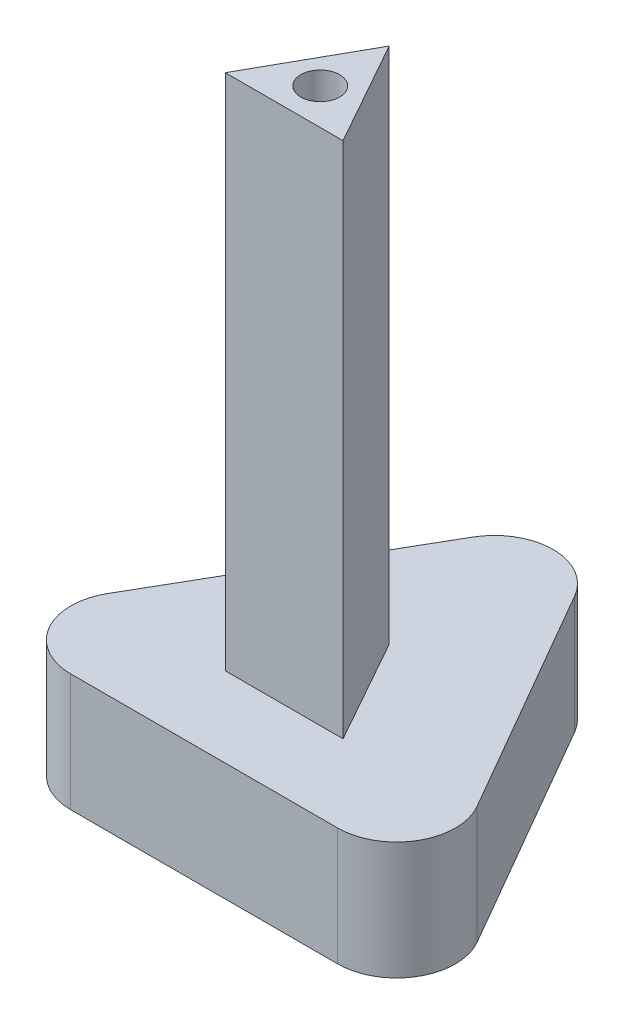
ISO-10303-21;
HEADER;
FILE_DESCRIPTION(('STEP AP214'),'2;1');
FILE_NAME('part.step','',(''),(''),'','','');
FILE_SCHEMA(('AUTOMOTIVE_DESIGN { 1 0 10303 214 1 1 1 1 }'));
ENDSEC;
DATA;
#1=APPLICATION_CONTEXT('core data for automotive mechanical design processes');
#2=APPLICATION_PROTOCOL_DEFINITION('international standard','automotive_design',2000,#1);
#3=PRODUCT_CONTEXT('',#1,'mechanical');
#4=PRODUCT('Part','Part','',(#3));
#5=PRODUCT_RELATED_PRODUCT_CATEGORY('part','',(#4));
#6=PRODUCT_DEFINITION_FORMATION('','',#4);
#7=PRODUCT_DEFINITION_CONTEXT('part definition',#1,'design');
#8=PRODUCT_DEFINITION('design','',#6,#7);
#9=PRODUCT_DEFINITION_SHAPE('','',#8);
#10=(LENGTH_UNIT() NAMED_UNIT(*) SI_UNIT(.MILLI.,.METRE.));
#11=(NAMED_UNIT(*) PLANE_ANGLE_UNIT() SI_UNIT($,.RADIAN.));
#12=(NAMED_UNIT(*) SI_UNIT($,.STERADIAN.) SOLID_ANGLE_UNIT());
#13=UNCERTAINTY_MEASURE_WITH_UNIT(LENGTH_MEASURE(1.E-05),#10,'distance_accuracy_value','');
#14=(GEOMETRIC_REPRESENTATION_CONTEXT(3) GLOBAL_UNCERTAINTY_ASSIGNED_CONTEXT((#13)) GLOBAL_UNIT_ASSIGNED_CONTEXT((#10,
#11,#12)) REPRESENTATION_CONTEXT('',''));
#15=CARTESIAN_POINT('',(0.,0.,0.));
#16=DIRECTION('',(0.,0.,1.));
#17=DIRECTION('',(1.,0.,0.));
#18=AXIS2_PLACEMENT_3D('',#15,#16,#17);
#19=CARTESIAN_POINT('',(0.,10.,0.));
#20=DIRECTION('',(0.,1.,0.));
#21=DIRECTION('',(0.,0.,1.));
#22=AXIS2_PLACEMENT_3D('',#19,#20,#21);
#23=PLANE('',#22);
#24=DIRECTION('',(1.,0.,0.));
#25=VECTOR('',#24,1.);
#26=CARTESIAN_POINT('',(-37.1130749278497,10.,31.8004158058112));
#27=LINE('',#26,#25);
#28=CARTESIAN_POINT('',(-28.4528208900053,10.,31.8004158058112));
#29=VERTEX_POINT('',#28);
#30=CARTESIAN_POINT('',(-5.7733289656941,10.,31.8004158058112));
#31=VERTEX_POINT('',#30);
#32=EDGE_CURVE('E172',#29,#31,#27,.T.);
#33=ORIENTED_EDGE('',*,*,#32,.T.);
#34=CARTESIAN_POINT('',(-5.7733289656941,10.,26.8004158058112));
#35=DIRECTION('',(0.,1.,0.));
#36=DIRECTION('',(0.,0.,1.));
#37=AXIS2_PLACEMENT_3D('',#34,#35,#36);
#38=CIRCLE('',#37,5.);
#39=CARTESIAN_POINT('',(-1.44320194677191,10.,24.3004158058112));
#40=VERTEX_POINT('',#39);
#41=EDGE_CURVE('E214',#31,#40,#38,.T.);
#42=ORIENTED_EDGE('',*,*,#41,.T.);
#43=DIRECTION('',(-0.499999999999998,0.,-0.86602540378444));
#44=VECTOR('',#43,1.);
#45=CARTESIAN_POINT('',(-17.1130749278496,10.,-2.84060034556624));
#46=LINE('',#45,#44);
#47=CARTESIAN_POINT('',(-12.7829479089274,10.,4.65939965443374));
#48=VERTEX_POINT('',#47);
#49=EDGE_CURVE('E164',#40,#48,#46,.T.);
#50=ORIENTED_EDGE('',*,*,#49,.T.);
#51=CARTESIAN_POINT('',(-17.1130749278496,10.,7.15939965443373));
#52=DIRECTION('',(0.,1.,0.));
#53=DIRECTION('',(0.,0.,1.));
#54=AXIS2_PLACEMENT_3D('',#51,#52,#53);
#55=CIRCLE('',#54,5.);
#56=CARTESIAN_POINT('',(-21.4432019467718,10.,4.65939965443371));
#57=VERTEX_POINT('',#56);
#58=EDGE_CURVE('E208',#48,#57,#55,.T.);
#59=ORIENTED_EDGE('',*,*,#58,.T.);
#60=DIRECTION('',(-0.500000000000004,0.,0.866025403784436));
#61=VECTOR('',#60,1.);
#62=CARTESIAN_POINT('',(-17.1130749278496,10.,-2.84060034556624));
#63=LINE('',#62,#61);
#64=CARTESIAN_POINT('',(-32.7829479089275,10.,24.3004158058112));
#65=VERTEX_POINT('',#64);
#66=EDGE_CURVE('E168',#57,#65,#63,.T.);
#67=ORIENTED_EDGE('',*,*,#66,.T.);
#68=CARTESIAN_POINT('',(-28.4528208900053,10.,26.8004158058112));
#69=DIRECTION('',(0.,1.,0.));
#70=DIRECTION('',(0.,0.,1.));
#71=AXIS2_PLACEMENT_3D('',#68,#69,#70);
#72=CIRCLE('',#71,5.);
#73=EDGE_CURVE('E211',#65,#29,#72,.T.);
#74=ORIENTED_EDGE('',*,*,#73,.T.);
#75=EDGE_LOOP('',(#33,#42,#50,#59,#67,#74));
#76=FACE_BOUND('',#75,.T.);
#77=DIRECTION('',(-1.,0.,0.));
#78=VECTOR('',#77,1.);
#79=CARTESIAN_POINT('',(-12.1130749278496,10.,25.011274713108));
#80=LINE('',#79,#78);
#81=CARTESIAN_POINT('',(-12.1130749278496,10.,25.011274713108));
#82=VERTEX_POINT('',#81);
#83=CARTESIAN_POINT('',(-22.1130749278496,10.,25.011274713108));
#84=VERTEX_POINT('',#83);
#85=EDGE_CURVE('E140',#82,#84,#80,.T.);
#86=ORIENTED_EDGE('',*,*,#85,.T.);
#87=DIRECTION('',(0.488747474137814,0.,-0.872425301400588));
#88=VECTOR('',#87,1.);
#89=CARTESIAN_POINT('',(-22.1130749278496,10.,25.011274713108));
#90=LINE('',#89,#88);
#91=CARTESIAN_POINT('',(-17.1130749278496,10.,16.0861615660824));
#92=VERTEX_POINT('',#91);
#93=EDGE_CURVE('E58',#84,#92,#90,.T.);
#94=ORIENTED_EDGE('',*,*,#93,.T.);
#95=DIRECTION('',(0.488747474137814,0.,0.872425301400588));
#96=VECTOR('',#95,1.);
#97=CARTESIAN_POINT('',(-17.1130749278496,10.,16.0861615660824));
#98=LINE('',#97,#96);
#99=EDGE_CURVE('E130',#92,#82,#98,.T.);
#100=ORIENTED_EDGE('',*,*,#99,.T.);
#101=EDGE_LOOP('',(#86,#94,#100));
#102=FACE_BOUND('',#101,.T.);
#103=ADVANCED_FACE('F42',(#76,#102),#23,.T.);
#104=CARTESIAN_POINT('',(-17.1130749278496,10.,-2.84060034556624));
#105=DIRECTION('',(-0.86602540378444,0.,0.499999999999998));
#106=DIRECTION('',(0.499999999999998,0.,0.86602540378444));
#107=AXIS2_PLACEMENT_3D('',#104,#105,#106);
#108=PLANE('',#107);
#109=ORIENTED_EDGE('',*,*,#49,.F.);
#110=DIRECTION('',(0.,-1.,0.));
#111=VECTOR('',#110,1.);
#112=CARTESIAN_POINT('',(-1.4432019467719,10.,24.3004158058112));
#113=LINE('',#112,#111);
#114=CARTESIAN_POINT('',(-1.44320194677191,0.,24.3004158058112));
#115=VERTEX_POINT('',#114);
#116=EDGE_CURVE('E188',#40,#115,#113,.T.);
#117=ORIENTED_EDGE('',*,*,#116,.T.);
#118=DIRECTION('',(-0.499999999999998,0.,-0.86602540378444));
#119=VECTOR('',#118,1.);
#120=CARTESIAN_POINT('',(-17.1130749278496,0.,-2.84060034556624));
#121=LINE('',#120,#119);
#122=CARTESIAN_POINT('',(-12.7829479089274,0.,4.65939965443374));
#123=VERTEX_POINT('',#122);
#124=EDGE_CURVE('E158',#115,#123,#121,.T.);
#125=ORIENTED_EDGE('',*,*,#124,.T.);
#126=DIRECTION('',(0.,-1.,0.));
#127=VECTOR('',#126,1.);
#128=CARTESIAN_POINT('',(-12.7829479089274,10.,4.65939965443374));
#129=LINE('',#128,#127);
#130=EDGE_CURVE('E176',#123,#48,#129,.F.);
#131=ORIENTED_EDGE('',*,*,#130,.T.);
#132=EDGE_LOOP('',(#109,#117,#125,#131));
#133=FACE_BOUND('',#132,.T.);
#134=ADVANCED_FACE('F243',(#133),#108,.F.);
#135=CARTESIAN_POINT('',(-17.1130749278496,10.,-2.84060034556624));
#136=DIRECTION('',(0.866025403784436,0.,0.500000000000004));
#137=DIRECTION('',(0.500000000000004,0.,-0.866025403784436));
#138=AXIS2_PLACEMENT_3D('',#135,#136,#137);
#139=PLANE('',#138);
#140=DIRECTION('',(-0.500000000000004,0.,0.866025403784436));
#141=VECTOR('',#140,1.);
#142=CARTESIAN_POINT('',(-17.1130749278496,0.,-2.84060034556624));
#143=LINE('',#142,#141);
#144=CARTESIAN_POINT('',(-21.4432019467718,0.,4.65939965443371));
#145=VERTEX_POINT('',#144);
#146=CARTESIAN_POINT('',(-32.7829479089275,0.,24.3004158058112));
#147=VERTEX_POINT('',#146);
#148=EDGE_CURVE('E180',#145,#147,#143,.T.);
#149=ORIENTED_EDGE('',*,*,#148,.T.);
#150=DIRECTION('',(0.,-1.,0.));
#151=VECTOR('',#150,1.);
#152=CARTESIAN_POINT('',(-32.7829479089275,10.,24.3004158058112));
#153=LINE('',#152,#151);
#154=EDGE_CURVE('E11',#147,#65,#153,.F.);
#155=ORIENTED_EDGE('',*,*,#154,.T.);
#156=ORIENTED_EDGE('',*,*,#66,.F.);
#157=DIRECTION('',(0.,-1.,0.));
#158=VECTOR('',#157,1.);
#159=CARTESIAN_POINT('',(-21.4432019467718,10.,4.65939965443371));
#160=LINE('',#159,#158);
#161=EDGE_CURVE('E51',#57,#145,#160,.T.);
#162=ORIENTED_EDGE('',*,*,#161,.T.);
#163=EDGE_LOOP('',(#149,#155,#156,#162));
#164=FACE_BOUND('',#163,.T.);
#165=ADVANCED_FACE('F220',(#164),#139,.F.);
#166=CARTESIAN_POINT('',(-37.1130749278497,10.,31.8004158058112));
#167=DIRECTION('',(0.,0.,-1.));
#168=DIRECTION('',(-1.,0.,0.));
#169=AXIS2_PLACEMENT_3D('',#166,#167,#168);
#170=PLANE('',#169);
#171=DIRECTION('',(1.,0.,0.));
#172=VECTOR('',#171,1.);
#173=CARTESIAN_POINT('',(-37.1130749278497,0.,31.8004158058112));
#174=LINE('',#173,#172);
#175=CARTESIAN_POINT('',(-28.4528208900053,0.,31.8004158058112));
#176=VERTEX_POINT('',#175);
#177=CARTESIAN_POINT('',(-5.7733289656941,0.,31.8004158058112));
#178=VERTEX_POINT('',#177);
#179=EDGE_CURVE('E169',#176,#178,#174,.T.);
#180=ORIENTED_EDGE('',*,*,#179,.T.);
#181=DIRECTION('',(0.,-1.,0.));
#182=VECTOR('',#181,1.);
#183=CARTESIAN_POINT('',(-5.7733289656941,10.,31.8004158058112));
#184=LINE('',#183,#182);
#185=EDGE_CURVE('E205',#178,#31,#184,.F.);
#186=ORIENTED_EDGE('',*,*,#185,.T.);
#187=ORIENTED_EDGE('',*,*,#32,.F.);
#188=DIRECTION('',(0.,-1.,0.));
#189=VECTOR('',#188,1.);
#190=CARTESIAN_POINT('',(-28.4528208900053,10.,31.8004158058112));
#191=LINE('',#190,#189);
#192=EDGE_CURVE('E201',#29,#176,#191,.T.);
#193=ORIENTED_EDGE('',*,*,#192,.T.);
#194=EDGE_LOOP('',(#180,#186,#187,#193));
#195=FACE_BOUND('',#194,.T.);
#196=ADVANCED_FACE('F233',(#195),#170,.F.);
#197=CARTESIAN_POINT('',(0.,0.,0.));
#198=DIRECTION('',(0.,1.,0.));
#199=DIRECTION('',(0.,0.,1.));
#200=AXIS2_PLACEMENT_3D('',#197,#198,#199);
#201=PLANE('',#200);
#202=ORIENTED_EDGE('',*,*,#124,.F.);
#203=CARTESIAN_POINT('',(-5.7733289656941,0.,26.8004158058112));
#204=DIRECTION('',(0.,1.,0.));
#205=DIRECTION('',(0.,0.,1.));
#206=AXIS2_PLACEMENT_3D('',#203,#204,#205);
#207=CIRCLE('',#206,5.);
#208=EDGE_CURVE('E198',#115,#178,#207,.F.);
#209=ORIENTED_EDGE('',*,*,#208,.T.);
#210=ORIENTED_EDGE('',*,*,#179,.F.);
#211=CARTESIAN_POINT('',(-28.4528208900053,0.,26.8004158058112));
#212=DIRECTION('',(0.,1.,0.));
#213=DIRECTION('',(0.,0.,1.));
#214=AXIS2_PLACEMENT_3D('',#211,#212,#213);
#215=CIRCLE('',#214,5.);
#216=EDGE_CURVE('E195',#176,#147,#215,.F.);
#217=ORIENTED_EDGE('',*,*,#216,.T.);
#218=ORIENTED_EDGE('',*,*,#148,.F.);
#219=CARTESIAN_POINT('',(-17.1130749278496,0.,7.15939965443373));
#220=DIRECTION('',(0.,1.,0.));
#221=DIRECTION('',(0.,0.,1.));
#222=AXIS2_PLACEMENT_3D('',#219,#220,#221);
#223=CIRCLE('',#222,5.);
#224=EDGE_CURVE('E192',#145,#123,#223,.F.);
#225=ORIENTED_EDGE('',*,*,#224,.T.);
#226=EDGE_LOOP('',(#202,#209,#210,#217,#218,#225));
#227=FACE_BOUND('',#226,.T.);
#228=ADVANCED_FACE('F225',(#227),#201,.F.);
#229=CARTESIAN_POINT('',(-5.7733289656941,10.,26.8004158058112));
#230=DIRECTION('',(0.,-1.,0.));
#231=DIRECTION('',(0.,0.,-1.));
#232=AXIS2_PLACEMENT_3D('',#229,#230,#231);
#233=CYLINDRICAL_SURFACE('',#232,5.);
#234=ORIENTED_EDGE('',*,*,#41,.F.);
#235=ORIENTED_EDGE('',*,*,#185,.F.);
#236=ORIENTED_EDGE('',*,*,#208,.F.);
#237=ORIENTED_EDGE('',*,*,#116,.F.);
#238=EDGE_LOOP('',(#234,#235,#236,#237));
#239=FACE_BOUND('',#238,.T.);
#240=ADVANCED_FACE('F241',(#239),#233,.T.);
#241=CARTESIAN_POINT('',(-28.4528208900053,10.,26.8004158058112));
#242=DIRECTION('',(0.,-1.,0.));
#243=DIRECTION('',(0.,0.,-1.));
#244=AXIS2_PLACEMENT_3D('',#241,#242,#243);
#245=CYLINDRICAL_SURFACE('',#244,5.);
#246=ORIENTED_EDGE('',*,*,#73,.F.);
#247=ORIENTED_EDGE('',*,*,#154,.F.);
#248=ORIENTED_EDGE('',*,*,#216,.F.);
#249=ORIENTED_EDGE('',*,*,#192,.F.);
#250=EDGE_LOOP('',(#246,#247,#248,#249));
#251=FACE_BOUND('',#250,.T.);
#252=ADVANCED_FACE('F230',(#251),#245,.T.);
#253=CARTESIAN_POINT('',(-17.1130749278496,10.,7.15939965443373));
#254=DIRECTION('',(0.,-1.,0.));
#255=DIRECTION('',(0.,0.,-1.));
#256=AXIS2_PLACEMENT_3D('',#253,#254,#255);
#257=CYLINDRICAL_SURFACE('',#256,5.);
#258=ORIENTED_EDGE('',*,*,#58,.F.);
#259=ORIENTED_EDGE('',*,*,#130,.F.);
#260=ORIENTED_EDGE('',*,*,#224,.F.);
#261=ORIENTED_EDGE('',*,*,#161,.F.);
#262=EDGE_LOOP('',(#258,#259,#260,#261));
#263=FACE_BOUND('',#262,.T.);
#264=ADVANCED_FACE('F44',(#263),#257,.T.);
#265=CARTESIAN_POINT('',(-22.1130749278496,54.,25.011274713108));
#266=DIRECTION('',(-0.872425301400588,0.,-0.488747474137814));
#267=DIRECTION('',(-0.488747474137814,0.,0.872425301400588));
#268=AXIS2_PLACEMENT_3D('',#265,#266,#267);
#269=PLANE('',#268);
#270=ORIENTED_EDGE('',*,*,#93,.F.);
#271=DIRECTION('',(0.,-1.,0.));
#272=VECTOR('',#271,1.);
#273=CARTESIAN_POINT('',(-22.1130749278496,54.,25.011274713108));
#274=LINE('',#273,#272);
#275=CARTESIAN_POINT('',(-22.1130749278496,54.,25.011274713108));
#276=VERTEX_POINT('',#275);
#277=EDGE_CURVE('E155',#276,#84,#274,.T.);
#278=ORIENTED_EDGE('',*,*,#277,.F.);
#279=DIRECTION('',(0.488747474137814,0.,-0.872425301400588));
#280=VECTOR('',#279,1.);
#281=CARTESIAN_POINT('',(-22.1130749278496,54.,25.011274713108));
#282=LINE('',#281,#280);
#283=CARTESIAN_POINT('',(-17.1130749278496,54.,16.0861615660824));
#284=VERTEX_POINT('',#283);
#285=EDGE_CURVE('E135',#276,#284,#282,.T.);
#286=ORIENTED_EDGE('',*,*,#285,.T.);
#287=DIRECTION('',(0.,-1.,0.));
#288=VECTOR('',#287,1.);
#289=CARTESIAN_POINT('',(-17.1130749278496,54.,16.0861615660824));
#290=LINE('',#289,#288);
#291=EDGE_CURVE('E147',#284,#92,#290,.T.);
#292=ORIENTED_EDGE('',*,*,#291,.T.);
#293=EDGE_LOOP('',(#270,#278,#286,#292));
#294=FACE_BOUND('',#293,.T.);
#295=ADVANCED_FACE('F246',(#294),#269,.T.);
#296=CARTESIAN_POINT('',(-12.1130749278496,54.,25.011274713108));
#297=DIRECTION('',(0.,0.,1.));
#298=DIRECTION('',(1.,0.,0.));
#299=AXIS2_PLACEMENT_3D('',#296,#297,#298);
#300=PLANE('',#299);
#301=ORIENTED_EDGE('',*,*,#85,.F.);
#302=DIRECTION('',(0.,-1.,0.));
#303=VECTOR('',#302,1.);
#304=CARTESIAN_POINT('',(-12.1130749278496,54.,25.011274713108));
#305=LINE('',#304,#303);
#306=CARTESIAN_POINT('',(-12.1130749278496,54.,25.011274713108));
#307=VERTEX_POINT('',#306);
#308=EDGE_CURVE('E159',#307,#82,#305,.T.);
#309=ORIENTED_EDGE('',*,*,#308,.F.);
#310=DIRECTION('',(-1.,0.,0.));
#311=VECTOR('',#310,1.);
#312=CARTESIAN_POINT('',(-12.1130749278496,54.,25.011274713108));
#313=LINE('',#312,#311);
#314=EDGE_CURVE('E144',#307,#276,#313,.T.);
#315=ORIENTED_EDGE('',*,*,#314,.T.);
#316=ORIENTED_EDGE('',*,*,#277,.T.);
#317=EDGE_LOOP('',(#301,#309,#315,#316));
#318=FACE_BOUND('',#317,.T.);
#319=ADVANCED_FACE('F251',(#318),#300,.T.);
#320=CARTESIAN_POINT('',(-17.1130749278496,54.,16.0861615660824));
#321=DIRECTION('',(0.872425301400588,0.,-0.488747474137814));
#322=DIRECTION('',(-0.488747474137814,0.,-0.872425301400588));
#323=AXIS2_PLACEMENT_3D('',#320,#321,#322);
#324=PLANE('',#323);
#325=ORIENTED_EDGE('',*,*,#99,.F.);
#326=ORIENTED_EDGE('',*,*,#291,.F.);
#327=DIRECTION('',(0.488747474137814,0.,0.872425301400588));
#328=VECTOR('',#327,1.);
#329=CARTESIAN_POINT('',(-17.1130749278496,54.,16.0861615660824));
#330=LINE('',#329,#328);
#331=EDGE_CURVE('E139',#284,#307,#330,.T.);
#332=ORIENTED_EDGE('',*,*,#331,.T.);
#333=ORIENTED_EDGE('',*,*,#308,.T.);
#334=EDGE_LOOP('',(#325,#326,#332,#333));
#335=FACE_BOUND('',#334,.T.);
#336=ADVANCED_FACE('F299',(#335),#324,.T.);
#337=CARTESIAN_POINT('',(0.,54.,0.));
#338=DIRECTION('',(0.,1.,0.));
#339=DIRECTION('',(0.,0.,1.));
#340=AXIS2_PLACEMENT_3D('',#337,#338,#339);
#341=PLANE('',#340);
#342=CARTESIAN_POINT('',(-17.1130749278496,54.,21.9492606082546));
#343=DIRECTION('',(0.,1.,0.));
#344=DIRECTION('',(0.,0.,1.));
#345=AXIS2_PLACEMENT_3D('',#342,#343,#344);
#346=CIRCLE('',#345,1.64999999999999);
#347=CARTESIAN_POINT('',(-17.1130749278496,54.,23.5992606082546));
#348=VERTEX_POINT('',#347);
#349=EDGE_CURVE('E126',#348,#348,#346,.T.);
#350=ORIENTED_EDGE('',*,*,#349,.F.);
#351=EDGE_LOOP('',(#350));
#352=FACE_BOUND('',#351,.T.);
#353=ORIENTED_EDGE('',*,*,#285,.F.);
#354=ORIENTED_EDGE('',*,*,#314,.F.);
#355=ORIENTED_EDGE('',*,*,#331,.F.);
#356=EDGE_LOOP('',(#353,#354,#355));
#357=FACE_BOUND('',#356,.T.);
#358=ADVANCED_FACE('F119',(#352,#357),#341,.T.);
#359=CARTESIAN_POINT('',(-17.1130749278496,43.9,21.9492606082546));
#360=DIRECTION('',(0.,1.,0.));
#361=DIRECTION('',(0.,0.,1.));
#362=AXIS2_PLACEMENT_3D('',#359,#360,#361);
#363=CONICAL_SURFACE('',#362,1.64999999999999,1.02974425867665);
#364=CARTESIAN_POINT('',(-17.1130749278496,42.9085799786045,21.9492606082546));
#365=VERTEX_POINT('',#364);
#366=VERTEX_LOOP('',#365);
#367=FACE_BOUND('',#366,.T.);
#368=CARTESIAN_POINT('',(-17.1130749278496,43.9,21.9492606082546));
#369=DIRECTION('',(0.,1.,0.));
#370=DIRECTION('',(0.,0.,1.));
#371=AXIS2_PLACEMENT_3D('',#368,#369,#370);
#372=CIRCLE('',#371,1.64999999999999);
#373=CARTESIAN_POINT('',(-17.1130749278496,43.9,23.5992606082546));
#374=VERTEX_POINT('',#373);
#375=EDGE_CURVE('E123',#374,#374,#372,.T.);
#376=ORIENTED_EDGE('',*,*,#375,.T.);
#377=EDGE_LOOP('',(#376));
#378=FACE_BOUND('',#377,.T.);
#379=ADVANCED_FACE('F115',(#367,#378),#363,.F.);
#380=CARTESIAN_POINT('',(-17.1130749278496,54.,21.9492606082546));
#381=DIRECTION('',(0.,1.,0.));
#382=DIRECTION('',(0.,0.,1.));
#383=AXIS2_PLACEMENT_3D('',#380,#381,#382);
#384=CYLINDRICAL_SURFACE('',#383,1.64999999999999);
#385=ORIENTED_EDGE('',*,*,#375,.F.);
#386=EDGE_LOOP('',(#385));
#387=FACE_BOUND('',#386,.T.);
#388=ORIENTED_EDGE('',*,*,#349,.T.);
#389=EDGE_LOOP('',(#388));
#390=FACE_BOUND('',#389,.T.);
#391=ADVANCED_FACE('F118',(#387,#390),#384,.F.);
#392=CLOSED_SHELL('',(#103,#134,#165,#196,#228,#240,#252,#264,#295,#319,#336,#358,#379,#391));
#393=MANIFOLD_SOLID_BREP('B2',#392);
#394=ADVANCED_BREP_SHAPE_REPRESENTATION('',(#18,#393),#14);
#395=SHAPE_DEFINITION_REPRESENTATION(#9,#394);
ENDSEC;
END-ISO-10303-21;
